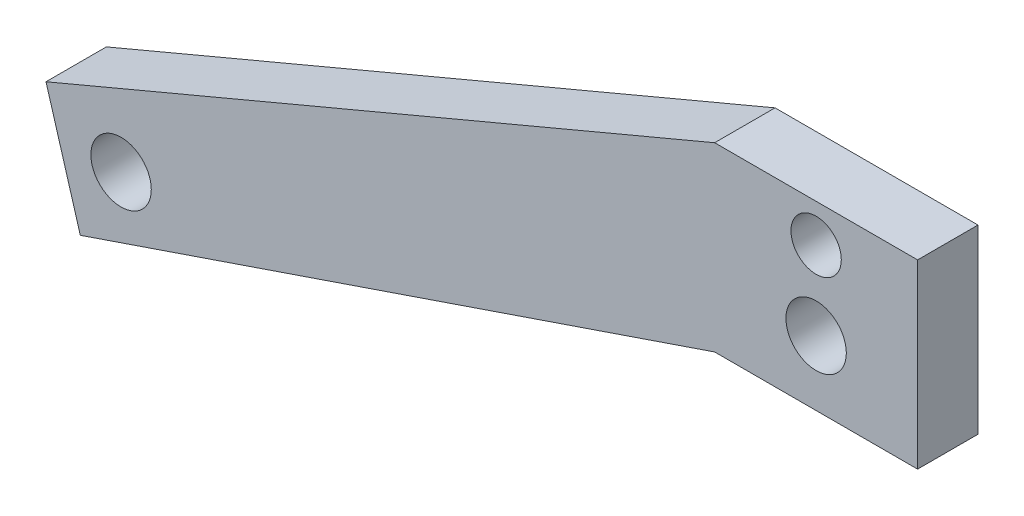
ISO-10303-21;
HEADER;
FILE_DESCRIPTION(('STEP AP214'),'2;1');
FILE_NAME('part.step','',(''),(''),'','','');
FILE_SCHEMA(('AUTOMOTIVE_DESIGN { 1 0 10303 214 1 1 1 1 }'));
ENDSEC;
DATA;
#1=APPLICATION_CONTEXT('core data for automotive mechanical design processes');
#2=APPLICATION_PROTOCOL_DEFINITION('international standard','automotive_design',2000,#1);
#3=PRODUCT_CONTEXT('',#1,'mechanical');
#4=PRODUCT('Part','Part','',(#3));
#5=PRODUCT_RELATED_PRODUCT_CATEGORY('part','',(#4));
#6=PRODUCT_DEFINITION_FORMATION('','',#4);
#7=PRODUCT_DEFINITION_CONTEXT('part definition',#1,'design');
#8=PRODUCT_DEFINITION('design','',#6,#7);
#9=PRODUCT_DEFINITION_SHAPE('','',#8);
#10=(LENGTH_UNIT() NAMED_UNIT(*) SI_UNIT(.MILLI.,.METRE.));
#11=(NAMED_UNIT(*) PLANE_ANGLE_UNIT() SI_UNIT($,.RADIAN.));
#12=(NAMED_UNIT(*) SI_UNIT($,.STERADIAN.) SOLID_ANGLE_UNIT());
#13=UNCERTAINTY_MEASURE_WITH_UNIT(LENGTH_MEASURE(1.E-05),#10,'distance_accuracy_value','');
#14=(GEOMETRIC_REPRESENTATION_CONTEXT(3) GLOBAL_UNCERTAINTY_ASSIGNED_CONTEXT((#13)) GLOBAL_UNIT_ASSIGNED_CONTEXT((#10,
#11,#12)) REPRESENTATION_CONTEXT('',''));
#15=CARTESIAN_POINT('',(0.,0.,0.));
#16=DIRECTION('',(0.,0.,1.));
#17=DIRECTION('',(1.,0.,0.));
#18=AXIS2_PLACEMENT_3D('',#15,#16,#17);
#19=CARTESIAN_POINT('',(-111.469211223285,-33.0186846371157,9.525));
#20=DIRECTION('',(-0.958819734868192,-0.284015344703924,0.));
#21=DIRECTION('',(0.284015344703924,-0.958819734868193,0.));
#22=AXIS2_PLACEMENT_3D('',#19,#20,#21);
#23=PLANE('',#22);
#24=DIRECTION('',(-0.284015344703924,0.958819734868193,0.));
#25=VECTOR('',#24,1.);
#26=CARTESIAN_POINT('',(-111.469211223285,-33.0186846371157,0.));
#27=LINE('',#26,#25);
#28=CARTESIAN_POINT('',(-116.0206222699,-17.6533784507847,0.));
#29=VERTEX_POINT('',#28);
#30=CARTESIAN_POINT('',(-121.43111458651,0.612137498454353,0.));
#31=VERTEX_POINT('',#30);
#32=EDGE_CURVE('E130',#29,#31,#27,.T.);
#33=ORIENTED_EDGE('',*,*,#32,.F.);
#34=DIRECTION('',(0.,0.,-1.));
#35=VECTOR('',#34,1.);
#36=CARTESIAN_POINT('',(-116.0206222699,-17.6533784507847,9.525));
#37=LINE('',#36,#35);
#38=CARTESIAN_POINT('',(-116.0206222699,-17.6533784507847,9.525));
#39=VERTEX_POINT('',#38);
#40=EDGE_CURVE('E11',#39,#29,#37,.T.);
#41=ORIENTED_EDGE('',*,*,#40,.F.);
#42=DIRECTION('',(-0.284015344703924,0.958819734868193,0.));
#43=VECTOR('',#42,1.);
#44=CARTESIAN_POINT('',(-111.469211223285,-33.0186846371157,9.525));
#45=LINE('',#44,#43);
#46=CARTESIAN_POINT('',(-121.43111458651,0.612137498454353,9.525));
#47=VERTEX_POINT('',#46);
#48=EDGE_CURVE('E254',#39,#47,#45,.T.);
#49=ORIENTED_EDGE('',*,*,#48,.T.);
#50=DIRECTION('',(0.,0.,-1.));
#51=VECTOR('',#50,1.);
#52=CARTESIAN_POINT('',(-121.43111458651,0.612137498454353,9.525));
#53=LINE('',#52,#51);
#54=EDGE_CURVE('E80',#47,#31,#53,.T.);
#55=ORIENTED_EDGE('',*,*,#54,.T.);
#56=EDGE_LOOP('',(#33,#41,#49,#55));
#57=FACE_BOUND('',#56,.T.);
#58=ADVANCED_FACE('F35',(#57),#23,.T.);
#59=CARTESIAN_POINT('',(-6.67832565468944,19.6010069054882,9.525));
#60=DIRECTION('',(0.322507972425375,-0.94656674763171,0.));
#61=DIRECTION('',(0.94656674763171,0.322507972425375,0.));
#62=AXIS2_PLACEMENT_3D('',#59,#60,#61);
#63=PLANE('',#62);
#64=DIRECTION('',(-0.94656674763171,-0.322507972425375,0.));
#65=VECTOR('',#64,1.);
#66=CARTESIAN_POINT('',(-6.67832565468944,19.6010069054882,0.));
#67=LINE('',#66,#65);
#68=CARTESIAN_POINT('',(-16.0000147581514,16.4249825417981,0.));
#69=VERTEX_POINT('',#68);
#70=EDGE_CURVE('E128',#69,#29,#67,.T.);
#71=ORIENTED_EDGE('',*,*,#70,.F.);
#72=DIRECTION('',(0.,0.,-1.));
#73=VECTOR('',#72,1.);
#74=CARTESIAN_POINT('',(-16.0000147581514,16.4249825417981,9.525));
#75=LINE('',#74,#73);
#76=CARTESIAN_POINT('',(-16.0000147581514,16.4249825417981,9.525));
#77=VERTEX_POINT('',#76);
#78=EDGE_CURVE('E44',#77,#69,#75,.T.);
#79=ORIENTED_EDGE('',*,*,#78,.F.);
#80=DIRECTION('',(-0.94656674763171,-0.322507972425375,0.));
#81=VECTOR('',#80,1.);
#82=CARTESIAN_POINT('',(-6.67832565468944,19.6010069054882,9.525));
#83=LINE('',#82,#81);
#84=EDGE_CURVE('E255',#77,#39,#83,.T.);
#85=ORIENTED_EDGE('',*,*,#84,.T.);
#86=ORIENTED_EDGE('',*,*,#40,.T.);
#87=EDGE_LOOP('',(#71,#79,#85,#86));
#88=FACE_BOUND('',#87,.T.);
#89=ADVANCED_FACE('F129',(#88),#63,.T.);
#90=CARTESIAN_POINT('',(0.,16.4249825417981,9.525));
#91=DIRECTION('',(0.,-1.,0.));
#92=DIRECTION('',(0.,0.,-1.));
#93=AXIS2_PLACEMENT_3D('',#90,#91,#92);
#94=PLANE('',#93);
#95=DIRECTION('',(-1.,0.,0.));
#96=VECTOR('',#95,1.);
#97=CARTESIAN_POINT('',(0.,16.4249825417981,0.));
#98=LINE('',#97,#96);
#99=CARTESIAN_POINT('',(15.9999852418487,16.4249825417981,0.));
#100=VERTEX_POINT('',#99);
#101=EDGE_CURVE('E124',#100,#69,#98,.T.);
#102=ORIENTED_EDGE('',*,*,#101,.F.);
#103=DIRECTION('',(0.,0.,-1.));
#104=VECTOR('',#103,1.);
#105=CARTESIAN_POINT('',(15.9999852418487,16.4249825417981,9.525));
#106=LINE('',#105,#104);
#107=CARTESIAN_POINT('',(15.9999852418487,16.4249825417981,9.525));
#108=VERTEX_POINT('',#107);
#109=EDGE_CURVE('E114',#108,#100,#106,.T.);
#110=ORIENTED_EDGE('',*,*,#109,.F.);
#111=DIRECTION('',(-1.,0.,0.));
#112=VECTOR('',#111,1.);
#113=CARTESIAN_POINT('',(0.,16.4249825417981,9.525));
#114=LINE('',#113,#112);
#115=EDGE_CURVE('E108',#108,#77,#114,.T.);
#116=ORIENTED_EDGE('',*,*,#115,.T.);
#117=ORIENTED_EDGE('',*,*,#78,.T.);
#118=EDGE_LOOP('',(#102,#110,#116,#117));
#119=FACE_BOUND('',#118,.T.);
#120=ADVANCED_FACE('F122',(#119),#94,.T.);
#121=CARTESIAN_POINT('',(15.9999852418487,0.,9.525));
#122=DIRECTION('',(-1.,0.,0.));
#123=DIRECTION('',(0.,-1.,0.));
#124=AXIS2_PLACEMENT_3D('',#121,#122,#123);
#125=PLANE('',#124);
#126=DIRECTION('',(0.,1.,0.));
#127=VECTOR('',#126,1.);
#128=CARTESIAN_POINT('',(15.9999852418487,0.,0.));
#129=LINE('',#128,#127);
#130=CARTESIAN_POINT('',(15.9999852418487,44.9999825417982,0.));
#131=VERTEX_POINT('',#130);
#132=EDGE_CURVE('E113',#100,#131,#129,.T.);
#133=ORIENTED_EDGE('',*,*,#132,.T.);
#134=DIRECTION('',(0.,0.,-1.));
#135=VECTOR('',#134,1.);
#136=CARTESIAN_POINT('',(15.9999852418487,44.9999825417982,9.525));
#137=LINE('',#136,#135);
#138=CARTESIAN_POINT('',(15.9999852418487,44.9999825417982,9.525));
#139=VERTEX_POINT('',#138);
#140=EDGE_CURVE('E98',#139,#131,#137,.T.);
#141=ORIENTED_EDGE('',*,*,#140,.F.);
#142=DIRECTION('',(0.,1.,0.));
#143=VECTOR('',#142,1.);
#144=CARTESIAN_POINT('',(15.9999852418487,0.,9.525));
#145=LINE('',#144,#143);
#146=EDGE_CURVE('E101',#108,#139,#145,.T.);
#147=ORIENTED_EDGE('',*,*,#146,.F.);
#148=ORIENTED_EDGE('',*,*,#109,.T.);
#149=EDGE_LOOP('',(#133,#141,#147,#148));
#150=FACE_BOUND('',#149,.T.);
#151=ADVANCED_FACE('F111',(#150),#125,.F.);
#152=CARTESIAN_POINT('',(0.,44.9999825417982,9.525));
#153=DIRECTION('',(0.,-1.,0.));
#154=DIRECTION('',(1.,0.,0.));
#155=AXIS2_PLACEMENT_3D('',#152,#153,#154);
#156=PLANE('',#155);
#157=DIRECTION('',(-1.,0.,0.));
#158=VECTOR('',#157,1.);
#159=CARTESIAN_POINT('',(0.,44.9999825417982,0.));
#160=LINE('',#159,#158);
#161=CARTESIAN_POINT('',(-16.0000147581514,44.9999825417982,0.));
#162=VERTEX_POINT('',#161);
#163=EDGE_CURVE('E134',#131,#162,#160,.T.);
#164=ORIENTED_EDGE('',*,*,#163,.T.);
#165=DIRECTION('',(0.,0.,-1.));
#166=VECTOR('',#165,1.);
#167=CARTESIAN_POINT('',(-16.0000147581514,44.9999825417982,9.525));
#168=LINE('',#167,#166);
#169=CARTESIAN_POINT('',(-16.0000147581514,44.9999825417982,9.525));
#170=VERTEX_POINT('',#169);
#171=EDGE_CURVE('E100',#170,#162,#168,.T.);
#172=ORIENTED_EDGE('',*,*,#171,.F.);
#173=DIRECTION('',(-1.,0.,0.));
#174=VECTOR('',#173,1.);
#175=CARTESIAN_POINT('',(0.,44.9999825417982,9.525));
#176=LINE('',#175,#174);
#177=EDGE_CURVE('E93',#139,#170,#176,.T.);
#178=ORIENTED_EDGE('',*,*,#177,.F.);
#179=ORIENTED_EDGE('',*,*,#140,.T.);
#180=EDGE_LOOP('',(#164,#172,#178,#179));
#181=FACE_BOUND('',#180,.T.);
#182=ADVANCED_FACE('F96',(#181),#156,.F.);
#183=CARTESIAN_POINT('',(-1.4758151708409E-05,38.9999825417983,9.525));
#184=DIRECTION('',(0.,0.,-1.));
#185=DIRECTION('',(-1.,0.,0.));
#186=AXIS2_PLACEMENT_3D('',#183,#184,#185);
#187=CYLINDRICAL_SURFACE('',#186,3.96875000000001);
#188=CARTESIAN_POINT('',(-1.4758151708409E-05,38.9999825417983,9.525));
#189=DIRECTION('',(0.,0.,1.));
#190=DIRECTION('',(1.,0.,0.));
#191=AXIS2_PLACEMENT_3D('',#188,#189,#190);
#192=CIRCLE('',#191,3.96875000000001);
#193=CARTESIAN_POINT('',(3.9687352418483,38.9999825417983,9.525));
#194=VERTEX_POINT('',#193);
#195=EDGE_CURVE('E256',#194,#194,#192,.T.);
#196=ORIENTED_EDGE('',*,*,#195,.T.);
#197=EDGE_LOOP('',(#196));
#198=FACE_BOUND('',#197,.T.);
#199=CARTESIAN_POINT('',(-1.4758151708409E-05,38.9999825417983,0.));
#200=DIRECTION('',(0.,0.,1.));
#201=DIRECTION('',(1.,0.,0.));
#202=AXIS2_PLACEMENT_3D('',#199,#200,#201);
#203=CIRCLE('',#202,3.96875000000001);
#204=CARTESIAN_POINT('',(3.9687352418483,38.9999825417983,0.));
#205=VERTEX_POINT('',#204);
#206=EDGE_CURVE('E148',#205,#205,#203,.T.);
#207=ORIENTED_EDGE('',*,*,#206,.F.);
#208=EDGE_LOOP('',(#207));
#209=FACE_BOUND('',#208,.T.);
#210=ADVANCED_FACE('F158',(#198,#209),#187,.F.);
#211=CARTESIAN_POINT('',(-1.47581513225414E-05,26.6475795817982,9.525));
#212=DIRECTION('',(0.,0.,-1.));
#213=DIRECTION('',(-1.,0.,0.));
#214=AXIS2_PLACEMENT_3D('',#211,#212,#213);
#215=CYLINDRICAL_SURFACE('',#214,4.76250000164186);
#216=CARTESIAN_POINT('',(-1.47581513225414E-05,26.6475795817982,9.525));
#217=DIRECTION('',(0.,0.,1.));
#218=DIRECTION('',(1.,0.,0.));
#219=AXIS2_PLACEMENT_3D('',#216,#217,#218);
#220=CIRCLE('',#219,4.76250000164186);
#221=CARTESIAN_POINT('',(4.76248524349053,26.6475795817982,9.525));
#222=VERTEX_POINT('',#221);
#223=EDGE_CURVE('E172',#222,#222,#220,.T.);
#224=ORIENTED_EDGE('',*,*,#223,.T.);
#225=EDGE_LOOP('',(#224));
#226=FACE_BOUND('',#225,.T.);
#227=CARTESIAN_POINT('',(-1.47581513225414E-05,26.6475795817982,0.));
#228=DIRECTION('',(0.,0.,1.));
#229=DIRECTION('',(1.,0.,0.));
#230=AXIS2_PLACEMENT_3D('',#227,#228,#229);
#231=CIRCLE('',#230,4.76250000164186);
#232=CARTESIAN_POINT('',(4.76248524349053,26.6475795817982,0.));
#233=VERTEX_POINT('',#232);
#234=EDGE_CURVE('E145',#233,#233,#231,.T.);
#235=ORIENTED_EDGE('',*,*,#234,.F.);
#236=EDGE_LOOP('',(#235));
#237=FACE_BOUND('',#236,.T.);
#238=ADVANCED_FACE('F160',(#226,#237),#215,.F.);
#239=CARTESIAN_POINT('',(-109.593110453586,-5.81537431786028,9.525));
#240=DIRECTION('',(0.,0.,-1.));
#241=DIRECTION('',(-1.,0.,0.));
#242=AXIS2_PLACEMENT_3D('',#239,#240,#241);
#243=CYLINDRICAL_SURFACE('',#242,4.76250000164186);
#244=CARTESIAN_POINT('',(-109.593110453586,-5.81537431786028,9.525));
#245=DIRECTION('',(0.,0.,1.));
#246=DIRECTION('',(1.,0.,0.));
#247=AXIS2_PLACEMENT_3D('',#244,#245,#246);
#248=CIRCLE('',#247,4.76250000164186);
#249=CARTESIAN_POINT('',(-104.830610451944,-5.81537431786028,9.525));
#250=VERTEX_POINT('',#249);
#251=EDGE_CURVE('E139',#250,#250,#248,.T.);
#252=ORIENTED_EDGE('',*,*,#251,.T.);
#253=EDGE_LOOP('',(#252));
#254=FACE_BOUND('',#253,.T.);
#255=CARTESIAN_POINT('',(-109.593110453586,-5.81537431786028,0.));
#256=DIRECTION('',(0.,0.,1.));
#257=DIRECTION('',(1.,0.,0.));
#258=AXIS2_PLACEMENT_3D('',#255,#256,#257);
#259=CIRCLE('',#258,4.76250000164186);
#260=CARTESIAN_POINT('',(-104.830610451944,-5.81537431786028,0.));
#261=VERTEX_POINT('',#260);
#262=EDGE_CURVE('E142',#261,#261,#259,.T.);
#263=ORIENTED_EDGE('',*,*,#262,.F.);
#264=EDGE_LOOP('',(#263));
#265=FACE_BOUND('',#264,.T.);
#266=ADVANCED_FACE('F37',(#254,#265),#243,.F.);
#267=CARTESIAN_POINT('',(-18.5020750339927,43.9465830800269,9.525));
#268=DIRECTION('',(0.388025835868133,-0.921648496281981,0.));
#269=DIRECTION('',(0.921648496281981,0.388025835868133,0.));
#270=AXIS2_PLACEMENT_3D('',#267,#268,#269);
#271=PLANE('',#270);
#272=DIRECTION('',(-0.921648496281981,-0.388025835868133,0.));
#273=VECTOR('',#272,1.);
#274=CARTESIAN_POINT('',(-18.5020750339927,43.9465830800269,0.));
#275=LINE('',#274,#273);
#276=EDGE_CURVE('E73',#162,#31,#275,.T.);
#277=ORIENTED_EDGE('',*,*,#276,.T.);
#278=ORIENTED_EDGE('',*,*,#54,.F.);
#279=DIRECTION('',(-0.921648496281981,-0.388025835868133,0.));
#280=VECTOR('',#279,1.);
#281=CARTESIAN_POINT('',(-18.5020750339927,43.9465830800269,9.525));
#282=LINE('',#281,#280);
#283=EDGE_CURVE('E52',#170,#47,#282,.T.);
#284=ORIENTED_EDGE('',*,*,#283,.F.);
#285=ORIENTED_EDGE('',*,*,#171,.T.);
#286=EDGE_LOOP('',(#277,#278,#284,#285));
#287=FACE_BOUND('',#286,.T.);
#288=ADVANCED_FACE('F167',(#287),#271,.F.);
#289=CARTESIAN_POINT('',(0.,0.,9.525));
#290=DIRECTION('',(0.,0.,1.));
#291=DIRECTION('',(1.,0.,0.));
#292=AXIS2_PLACEMENT_3D('',#289,#290,#291);
#293=PLANE('',#292);
#294=ORIENTED_EDGE('',*,*,#251,.F.);
#295=EDGE_LOOP('',(#294));
#296=FACE_BOUND('',#295,.T.);
#297=ORIENTED_EDGE('',*,*,#223,.F.);
#298=EDGE_LOOP('',(#297));
#299=FACE_BOUND('',#298,.T.);
#300=ORIENTED_EDGE('',*,*,#195,.F.);
#301=EDGE_LOOP('',(#300));
#302=FACE_BOUND('',#301,.T.);
#303=ORIENTED_EDGE('',*,*,#48,.F.);
#304=ORIENTED_EDGE('',*,*,#84,.F.);
#305=ORIENTED_EDGE('',*,*,#115,.F.);
#306=ORIENTED_EDGE('',*,*,#146,.T.);
#307=ORIENTED_EDGE('',*,*,#177,.T.);
#308=ORIENTED_EDGE('',*,*,#283,.T.);
#309=EDGE_LOOP('',(#303,#304,#305,#306,#307,#308));
#310=FACE_BOUND('',#309,.T.);
#311=ADVANCED_FACE('F105',(#296,#299,#302,#310),#293,.T.);
#312=CARTESIAN_POINT('',(0.,0.,0.));
#313=DIRECTION('',(0.,0.,1.));
#314=DIRECTION('',(1.,0.,0.));
#315=AXIS2_PLACEMENT_3D('',#312,#313,#314);
#316=PLANE('',#315);
#317=ORIENTED_EDGE('',*,*,#262,.T.);
#318=EDGE_LOOP('',(#317));
#319=FACE_BOUND('',#318,.T.);
#320=ORIENTED_EDGE('',*,*,#234,.T.);
#321=EDGE_LOOP('',(#320));
#322=FACE_BOUND('',#321,.T.);
#323=ORIENTED_EDGE('',*,*,#206,.T.);
#324=EDGE_LOOP('',(#323));
#325=FACE_BOUND('',#324,.T.);
#326=ORIENTED_EDGE('',*,*,#32,.T.);
#327=ORIENTED_EDGE('',*,*,#276,.F.);
#328=ORIENTED_EDGE('',*,*,#163,.F.);
#329=ORIENTED_EDGE('',*,*,#132,.F.);
#330=ORIENTED_EDGE('',*,*,#101,.T.);
#331=ORIENTED_EDGE('',*,*,#70,.T.);
#332=EDGE_LOOP('',(#326,#327,#328,#329,#330,#331));
#333=FACE_BOUND('',#332,.T.);
#334=ADVANCED_FACE('F132',(#319,#322,#325,#333),#316,.F.);
#335=CLOSED_SHELL('',(#58,#89,#120,#151,#182,#210,#238,#266,#288,#311,#334));
#336=MANIFOLD_SOLID_BREP('B2',#335);
#337=ADVANCED_BREP_SHAPE_REPRESENTATION('',(#18,#336),#14);
#338=SHAPE_DEFINITION_REPRESENTATION(#9,#337);
ENDSEC;
END-ISO-10303-21;
